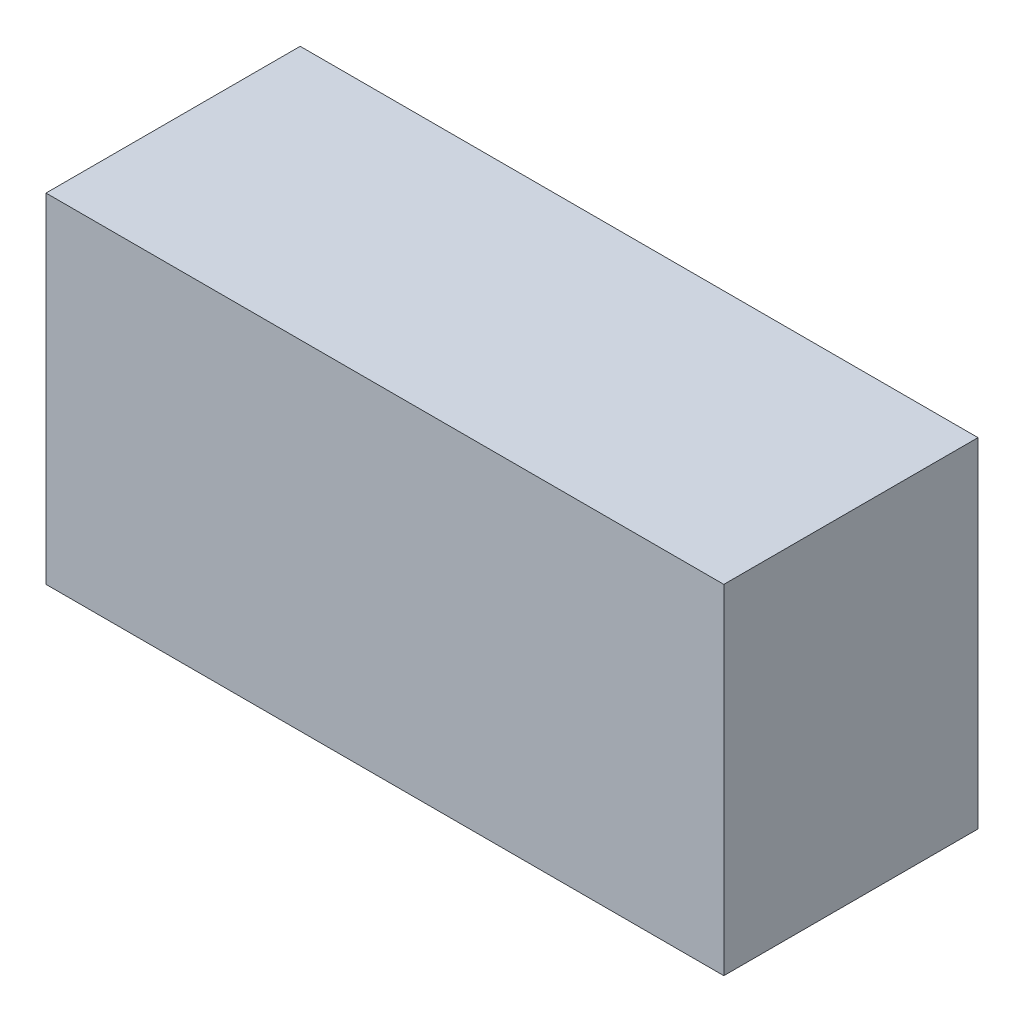
ISO-10303-21;
HEADER;
FILE_DESCRIPTION(('STEP AP214'),'2;1');
FILE_NAME('part.step','',(''),(''),'','','');
FILE_SCHEMA(('AUTOMOTIVE_DESIGN { 1 0 10303 214 1 1 1 1 }'));
ENDSEC;
DATA;
#1=APPLICATION_CONTEXT('core data for automotive mechanical design processes');
#2=APPLICATION_PROTOCOL_DEFINITION('international standard','automotive_design',2000,#1);
#3=PRODUCT_CONTEXT('',#1,'mechanical');
#4=PRODUCT('Part','Part','',(#3));
#5=PRODUCT_RELATED_PRODUCT_CATEGORY('part','',(#4));
#6=PRODUCT_DEFINITION_FORMATION('','',#4);
#7=PRODUCT_DEFINITION_CONTEXT('part definition',#1,'design');
#8=PRODUCT_DEFINITION('design','',#6,#7);
#9=PRODUCT_DEFINITION_SHAPE('','',#8);
#10=(LENGTH_UNIT() NAMED_UNIT(*) SI_UNIT(.MILLI.,.METRE.));
#11=(NAMED_UNIT(*) PLANE_ANGLE_UNIT() SI_UNIT($,.RADIAN.));
#12=(NAMED_UNIT(*) SI_UNIT($,.STERADIAN.) SOLID_ANGLE_UNIT());
#13=UNCERTAINTY_MEASURE_WITH_UNIT(LENGTH_MEASURE(1.E-05),#10,'distance_accuracy_value','');
#14=(GEOMETRIC_REPRESENTATION_CONTEXT(3) GLOBAL_UNCERTAINTY_ASSIGNED_CONTEXT((#13)) GLOBAL_UNIT_ASSIGNED_CONTEXT((#10,
#11,#12)) REPRESENTATION_CONTEXT('',''));
#15=CARTESIAN_POINT('',(0.,0.,0.));
#16=DIRECTION('',(0.,0.,1.));
#17=DIRECTION('',(1.,0.,0.));
#18=AXIS2_PLACEMENT_3D('',#15,#16,#17);
#19=CARTESIAN_POINT('',(0.80000094,-0.3999992,0.));
#20=DIRECTION('',(-1.,0.,0.));
#21=DIRECTION('',(0.,1.,0.));
#22=AXIS2_PLACEMENT_3D('',#19,#20,#21);
#23=PLANE('',#22);
#24=DIRECTION('',(0.,1.,0.));
#25=VECTOR('',#24,1.);
#26=CARTESIAN_POINT('',(0.80000094,-0.3999992,0.));
#27=LINE('',#26,#25);
#28=CARTESIAN_POINT('',(0.80000094,-0.3999992,0.));
#29=VERTEX_POINT('',#28);
#30=CARTESIAN_POINT('',(0.80000094,0.40000174,0.));
#31=VERTEX_POINT('',#30);
#32=EDGE_CURVE('E11',#29,#31,#27,.T.);
#33=ORIENTED_EDGE('',*,*,#32,.T.);
#34=DIRECTION('',(0.,0.,1.));
#35=VECTOR('',#34,1.);
#36=CARTESIAN_POINT('',(0.80000094,0.40000174,0.));
#37=LINE('',#36,#35);
#38=CARTESIAN_POINT('',(0.80000094,0.40000174,0.5999988));
#39=VERTEX_POINT('',#38);
#40=EDGE_CURVE('E24',#31,#39,#37,.T.);
#41=ORIENTED_EDGE('',*,*,#40,.T.);
#42=DIRECTION('',(0.,1.,0.));
#43=VECTOR('',#42,1.);
#44=CARTESIAN_POINT('',(0.80000094,-0.3999992,0.5999988));
#45=LINE('',#44,#43);
#46=CARTESIAN_POINT('',(0.80000094,-0.3999992,0.5999988));
#47=VERTEX_POINT('',#46);
#48=EDGE_CURVE('E87',#47,#39,#45,.T.);
#49=ORIENTED_EDGE('',*,*,#48,.F.);
#50=DIRECTION('',(0.,0.,1.));
#51=VECTOR('',#50,1.);
#52=CARTESIAN_POINT('',(0.80000094,-0.3999992,0.));
#53=LINE('',#52,#51);
#54=EDGE_CURVE('E36',#29,#47,#53,.T.);
#55=ORIENTED_EDGE('',*,*,#54,.F.);
#56=EDGE_LOOP('',(#33,#41,#49,#55));
#57=FACE_BOUND('',#56,.T.);
#58=ADVANCED_FACE('F17',(#57),#23,.F.);
#59=CARTESIAN_POINT('',(0.80000094,0.40000174,0.));
#60=DIRECTION('',(0.,-1.,0.));
#61=DIRECTION('',(-1.,0.,0.));
#62=AXIS2_PLACEMENT_3D('',#59,#60,#61);
#63=PLANE('',#62);
#64=DIRECTION('',(-1.,0.,0.));
#65=VECTOR('',#64,1.);
#66=CARTESIAN_POINT('',(0.80000094,0.40000174,0.));
#67=LINE('',#66,#65);
#68=CARTESIAN_POINT('',(-0.7999984,0.40000174,0.));
#69=VERTEX_POINT('',#68);
#70=EDGE_CURVE('E84',#31,#69,#67,.T.);
#71=ORIENTED_EDGE('',*,*,#70,.T.);
#72=DIRECTION('',(0.,0.,1.));
#73=VECTOR('',#72,1.);
#74=CARTESIAN_POINT('',(-0.7999984,0.40000174,0.));
#75=LINE('',#74,#73);
#76=CARTESIAN_POINT('',(-0.7999984,0.40000174,0.5999988));
#77=VERTEX_POINT('',#76);
#78=EDGE_CURVE('E82',#69,#77,#75,.T.);
#79=ORIENTED_EDGE('',*,*,#78,.T.);
#80=DIRECTION('',(-1.,0.,0.));
#81=VECTOR('',#80,1.);
#82=CARTESIAN_POINT('',(0.80000094,0.40000174,0.5999988));
#83=LINE('',#82,#81);
#84=EDGE_CURVE('E62',#39,#77,#83,.T.);
#85=ORIENTED_EDGE('',*,*,#84,.F.);
#86=ORIENTED_EDGE('',*,*,#40,.F.);
#87=EDGE_LOOP('',(#71,#79,#85,#86));
#88=FACE_BOUND('',#87,.T.);
#89=ADVANCED_FACE('F89',(#88),#63,.F.);
#90=CARTESIAN_POINT('',(-0.7999984,0.40000174,0.));
#91=DIRECTION('',(1.,0.,0.));
#92=DIRECTION('',(0.,-1.,0.));
#93=AXIS2_PLACEMENT_3D('',#90,#91,#92);
#94=PLANE('',#93);
#95=DIRECTION('',(0.,-1.,0.));
#96=VECTOR('',#95,1.);
#97=CARTESIAN_POINT('',(-0.7999984,0.40000174,0.));
#98=LINE('',#97,#96);
#99=CARTESIAN_POINT('',(-0.7999984,-0.3999992,0.));
#100=VERTEX_POINT('',#99);
#101=EDGE_CURVE('E71',#69,#100,#98,.T.);
#102=ORIENTED_EDGE('',*,*,#101,.T.);
#103=DIRECTION('',(0.,0.,1.));
#104=VECTOR('',#103,1.);
#105=CARTESIAN_POINT('',(-0.7999984,-0.3999992,0.));
#106=LINE('',#105,#104);
#107=CARTESIAN_POINT('',(-0.7999984,-0.3999992,0.5999988));
#108=VERTEX_POINT('',#107);
#109=EDGE_CURVE('E65',#100,#108,#106,.T.);
#110=ORIENTED_EDGE('',*,*,#109,.T.);
#111=DIRECTION('',(0.,-1.,0.));
#112=VECTOR('',#111,1.);
#113=CARTESIAN_POINT('',(-0.7999984,0.40000174,0.5999988));
#114=LINE('',#113,#112);
#115=EDGE_CURVE('E57',#77,#108,#114,.T.);
#116=ORIENTED_EDGE('',*,*,#115,.F.);
#117=ORIENTED_EDGE('',*,*,#78,.F.);
#118=EDGE_LOOP('',(#102,#110,#116,#117));
#119=FACE_BOUND('',#118,.T.);
#120=ADVANCED_FACE('F69',(#119),#94,.F.);
#121=CARTESIAN_POINT('',(-0.7999984,-0.3999992,0.));
#122=DIRECTION('',(0.,1.,0.));
#123=DIRECTION('',(1.,0.,0.));
#124=AXIS2_PLACEMENT_3D('',#121,#122,#123);
#125=PLANE('',#124);
#126=DIRECTION('',(1.,0.,0.));
#127=VECTOR('',#126,1.);
#128=CARTESIAN_POINT('',(-0.7999984,-0.3999992,0.));
#129=LINE('',#128,#127);
#130=EDGE_CURVE('E66',#100,#29,#129,.T.);
#131=ORIENTED_EDGE('',*,*,#130,.T.);
#132=ORIENTED_EDGE('',*,*,#54,.T.);
#133=DIRECTION('',(1.,0.,0.));
#134=VECTOR('',#133,1.);
#135=CARTESIAN_POINT('',(-0.7999984,-0.3999992,0.5999988));
#136=LINE('',#135,#134);
#137=EDGE_CURVE('E61',#108,#47,#136,.T.);
#138=ORIENTED_EDGE('',*,*,#137,.F.);
#139=ORIENTED_EDGE('',*,*,#109,.F.);
#140=EDGE_LOOP('',(#131,#132,#138,#139));
#141=FACE_BOUND('',#140,.T.);
#142=ADVANCED_FACE('F76',(#141),#125,.F.);
#143=CARTESIAN_POINT('',(0.80000094,-0.3999992,0.));
#144=DIRECTION('',(0.,0.,-1.));
#145=DIRECTION('',(-1.,0.,0.));
#146=AXIS2_PLACEMENT_3D('',#143,#144,#145);
#147=PLANE('',#146);
#148=ORIENTED_EDGE('',*,*,#130,.F.);
#149=ORIENTED_EDGE('',*,*,#101,.F.);
#150=ORIENTED_EDGE('',*,*,#70,.F.);
#151=ORIENTED_EDGE('',*,*,#32,.F.);
#152=EDGE_LOOP('',(#148,#149,#150,#151));
#153=FACE_BOUND('',#152,.T.);
#154=ADVANCED_FACE('F91',(#153),#147,.T.);
#155=CARTESIAN_POINT('',(0.80000094,-0.3999992,0.5999988));
#156=DIRECTION('',(0.,0.,-1.));
#157=DIRECTION('',(-1.,0.,0.));
#158=AXIS2_PLACEMENT_3D('',#155,#156,#157);
#159=PLANE('',#158);
#160=ORIENTED_EDGE('',*,*,#48,.T.);
#161=ORIENTED_EDGE('',*,*,#84,.T.);
#162=ORIENTED_EDGE('',*,*,#115,.T.);
#163=ORIENTED_EDGE('',*,*,#137,.T.);
#164=EDGE_LOOP('',(#160,#161,#162,#163));
#165=FACE_BOUND('',#164,.T.);
#166=ADVANCED_FACE('F59',(#165),#159,.F.);
#167=CLOSED_SHELL('',(#58,#89,#120,#142,#154,#166));
#168=MANIFOLD_SOLID_BREP('B1',#167);
#169=ADVANCED_BREP_SHAPE_REPRESENTATION('',(#18,#168),#14);
#170=SHAPE_DEFINITION_REPRESENTATION(#9,#169);
ENDSEC;
END-ISO-10303-21;
